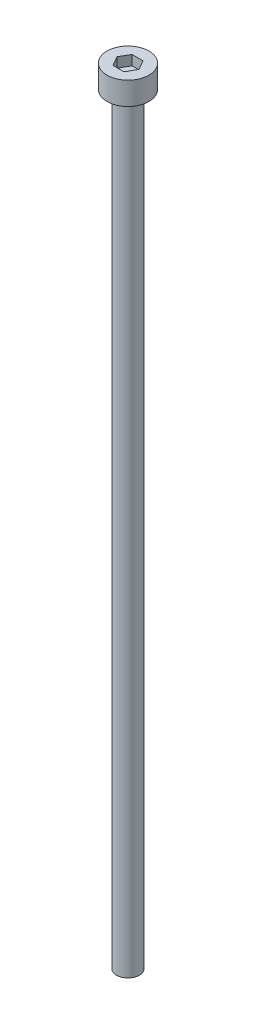
ISO-10303-21;
HEADER;
FILE_DESCRIPTION(('STEP AP214'),'2;1');
FILE_NAME('part.step','',(''),(''),'','','');
FILE_SCHEMA(('AUTOMOTIVE_DESIGN { 1 0 10303 214 1 1 1 1 }'));
ENDSEC;
DATA;
#1=APPLICATION_CONTEXT('core data for automotive mechanical design processes');
#2=APPLICATION_PROTOCOL_DEFINITION('international standard','automotive_design',2000,#1);
#3=PRODUCT_CONTEXT('',#1,'mechanical');
#4=PRODUCT('Part','Part','',(#3));
#5=PRODUCT_RELATED_PRODUCT_CATEGORY('part','',(#4));
#6=PRODUCT_DEFINITION_FORMATION('','',#4);
#7=PRODUCT_DEFINITION_CONTEXT('part definition',#1,'design');
#8=PRODUCT_DEFINITION('design','',#6,#7);
#9=PRODUCT_DEFINITION_SHAPE('','',#8);
#10=(LENGTH_UNIT() NAMED_UNIT(*) SI_UNIT(.MILLI.,.METRE.));
#11=(NAMED_UNIT(*) PLANE_ANGLE_UNIT() SI_UNIT($,.RADIAN.));
#12=(NAMED_UNIT(*) SI_UNIT($,.STERADIAN.) SOLID_ANGLE_UNIT());
#13=UNCERTAINTY_MEASURE_WITH_UNIT(LENGTH_MEASURE(1.E-05),#10,'distance_accuracy_value','');
#14=(GEOMETRIC_REPRESENTATION_CONTEXT(3) GLOBAL_UNCERTAINTY_ASSIGNED_CONTEXT((#13)) GLOBAL_UNIT_ASSIGNED_CONTEXT((#10,
#11,#12)) REPRESENTATION_CONTEXT('',''));
#15=CARTESIAN_POINT('',(0.,0.,0.));
#16=DIRECTION('',(0.,0.,1.));
#17=DIRECTION('',(1.,0.,0.));
#18=AXIS2_PLACEMENT_3D('',#15,#16,#17);
#19=CARTESIAN_POINT('',(0.,3.,0.));
#20=DIRECTION('',(0.,-1.,0.));
#21=DIRECTION('',(0.,0.,-1.));
#22=AXIS2_PLACEMENT_3D('',#19,#20,#21);
#23=CYLINDRICAL_SURFACE('',#22,2.75);
#24=CARTESIAN_POINT('',(0.,3.,0.));
#25=DIRECTION('',(0.,1.,0.));
#26=DIRECTION('',(0.,0.,1.));
#27=AXIS2_PLACEMENT_3D('',#24,#25,#26);
#28=CIRCLE('',#27,2.75);
#29=CARTESIAN_POINT('',(0.,3.,2.75));
#30=VERTEX_POINT('',#29);
#31=EDGE_CURVE('E45',#30,#30,#28,.T.);
#32=ORIENTED_EDGE('',*,*,#31,.F.);
#33=EDGE_LOOP('',(#32));
#34=FACE_BOUND('',#33,.T.);
#35=CARTESIAN_POINT('',(0.,0.,0.));
#36=DIRECTION('',(0.,1.,0.));
#37=DIRECTION('',(0.,0.,1.));
#38=AXIS2_PLACEMENT_3D('',#35,#36,#37);
#39=CIRCLE('',#38,2.75);
#40=CARTESIAN_POINT('',(0.,0.,2.75));
#41=VERTEX_POINT('',#40);
#42=EDGE_CURVE('E40',#41,#41,#39,.T.);
#43=ORIENTED_EDGE('',*,*,#42,.T.);
#44=EDGE_LOOP('',(#43));
#45=FACE_BOUND('',#44,.T.);
#46=ADVANCED_FACE('F37',(#34,#45),#23,.T.);
#47=CARTESIAN_POINT('',(0.,3.,0.));
#48=DIRECTION('',(0.,1.,0.));
#49=DIRECTION('',(0.,0.,1.));
#50=AXIS2_PLACEMENT_3D('',#47,#48,#49);
#51=PLANE('',#50);
#52=DIRECTION('',(0.5,0.,-0.866025403784439));
#53=VECTOR('',#52,1.);
#54=CARTESIAN_POINT('',(0.721687836487032,3.,1.25));
#55=LINE('',#54,#53);
#56=CARTESIAN_POINT('',(0.721687836487032,3.,1.25));
#57=VERTEX_POINT('',#56);
#58=CARTESIAN_POINT('',(1.44337567297406,3.,0.));
#59=VERTEX_POINT('',#58);
#60=EDGE_CURVE('E53',#57,#59,#55,.T.);
#61=ORIENTED_EDGE('',*,*,#60,.F.);
#62=DIRECTION('',(1.,0.,0.));
#63=VECTOR('',#62,1.);
#64=CARTESIAN_POINT('',(-0.721687836487033,3.,1.25));
#65=LINE('',#64,#63);
#66=CARTESIAN_POINT('',(-0.721687836487033,3.,1.25));
#67=VERTEX_POINT('',#66);
#68=EDGE_CURVE('E137',#67,#57,#65,.T.);
#69=ORIENTED_EDGE('',*,*,#68,.F.);
#70=DIRECTION('',(0.5,0.,0.866025403784439));
#71=VECTOR('',#70,1.);
#72=CARTESIAN_POINT('',(-1.44337567297407,3.,0.));
#73=LINE('',#72,#71);
#74=CARTESIAN_POINT('',(-1.44337567297407,3.,0.));
#75=VERTEX_POINT('',#74);
#76=EDGE_CURVE('E135',#75,#67,#73,.T.);
#77=ORIENTED_EDGE('',*,*,#76,.F.);
#78=DIRECTION('',(-0.5,0.,0.866025403784438));
#79=VECTOR('',#78,1.);
#80=CARTESIAN_POINT('',(-0.721687836487033,3.,-1.25));
#81=LINE('',#80,#79);
#82=CARTESIAN_POINT('',(-0.721687836487033,3.,-1.25));
#83=VERTEX_POINT('',#82);
#84=EDGE_CURVE('E101',#83,#75,#81,.T.);
#85=ORIENTED_EDGE('',*,*,#84,.F.);
#86=DIRECTION('',(-1.,0.,0.));
#87=VECTOR('',#86,1.);
#88=CARTESIAN_POINT('',(0.721687836487032,3.,-1.25));
#89=LINE('',#88,#87);
#90=CARTESIAN_POINT('',(0.721687836487032,3.,-1.25));
#91=VERTEX_POINT('',#90);
#92=EDGE_CURVE('E131',#91,#83,#89,.T.);
#93=ORIENTED_EDGE('',*,*,#92,.F.);
#94=DIRECTION('',(-0.5,0.,-0.866025403784439));
#95=VECTOR('',#94,1.);
#96=CARTESIAN_POINT('',(1.44337567297406,3.,0.));
#97=LINE('',#96,#95);
#98=EDGE_CURVE('E127',#59,#91,#97,.T.);
#99=ORIENTED_EDGE('',*,*,#98,.F.);
#100=EDGE_LOOP('',(#61,#69,#77,#85,#93,#99));
#101=FACE_BOUND('',#100,.T.);
#102=ORIENTED_EDGE('',*,*,#31,.T.);
#103=EDGE_LOOP('',(#102));
#104=FACE_BOUND('',#103,.T.);
#105=ADVANCED_FACE('F155',(#101,#104),#51,.T.);
#106=CARTESIAN_POINT('',(0.,0.,0.));
#107=DIRECTION('',(0.,1.,0.));
#108=DIRECTION('',(0.,0.,1.));
#109=AXIS2_PLACEMENT_3D('',#106,#107,#108);
#110=PLANE('',#109);
#111=CARTESIAN_POINT('',(0.,0.,0.));
#112=DIRECTION('',(0.,-1.,0.));
#113=DIRECTION('',(0.,0.,-1.));
#114=AXIS2_PLACEMENT_3D('',#111,#112,#113);
#115=CIRCLE('',#114,1.5);
#116=CARTESIAN_POINT('',(0.,0.,-1.5));
#117=VERTEX_POINT('',#116);
#118=EDGE_CURVE('E11',#117,#117,#115,.T.);
#119=ORIENTED_EDGE('',*,*,#118,.F.);
#120=EDGE_LOOP('',(#119));
#121=FACE_BOUND('',#120,.T.);
#122=ORIENTED_EDGE('',*,*,#42,.F.);
#123=EDGE_LOOP('',(#122));
#124=FACE_BOUND('',#123,.T.);
#125=ADVANCED_FACE('F152',(#121,#124),#110,.F.);
#126=CARTESIAN_POINT('',(0.721687836487032,1.7,1.25));
#127=DIRECTION('',(0.866025403784439,0.,0.5));
#128=DIRECTION('',(0.5,0.,-0.866025403784439));
#129=AXIS2_PLACEMENT_3D('',#126,#127,#128);
#130=PLANE('',#129);
#131=ORIENTED_EDGE('',*,*,#60,.T.);
#132=DIRECTION('',(0.,1.,0.));
#133=VECTOR('',#132,1.);
#134=CARTESIAN_POINT('',(1.44337567297406,1.7,0.));
#135=LINE('',#134,#133);
#136=CARTESIAN_POINT('',(1.44337567297406,1.7,0.));
#137=VERTEX_POINT('',#136);
#138=EDGE_CURVE('E83',#137,#59,#135,.T.);
#139=ORIENTED_EDGE('',*,*,#138,.F.);
#140=DIRECTION('',(0.5,0.,-0.866025403784439));
#141=VECTOR('',#140,1.);
#142=CARTESIAN_POINT('',(0.721687836487032,1.7,1.25));
#143=LINE('',#142,#141);
#144=CARTESIAN_POINT('',(0.721687836487032,1.7,1.25));
#145=VERTEX_POINT('',#144);
#146=EDGE_CURVE('E139',#145,#137,#143,.T.);
#147=ORIENTED_EDGE('',*,*,#146,.F.);
#148=DIRECTION('',(0.,1.,0.));
#149=VECTOR('',#148,1.);
#150=CARTESIAN_POINT('',(0.721687836487032,1.7,1.25));
#151=LINE('',#150,#149);
#152=EDGE_CURVE('E61',#145,#57,#151,.T.);
#153=ORIENTED_EDGE('',*,*,#152,.T.);
#154=EDGE_LOOP('',(#131,#139,#147,#153));
#155=FACE_BOUND('',#154,.T.);
#156=ADVANCED_FACE('F154',(#155),#130,.F.);
#157=CARTESIAN_POINT('',(-0.721687836487033,1.7,1.25));
#158=DIRECTION('',(0.,0.,1.));
#159=DIRECTION('',(1.,0.,0.));
#160=AXIS2_PLACEMENT_3D('',#157,#158,#159);
#161=PLANE('',#160);
#162=ORIENTED_EDGE('',*,*,#68,.T.);
#163=ORIENTED_EDGE('',*,*,#152,.F.);
#164=DIRECTION('',(1.,0.,0.));
#165=VECTOR('',#164,1.);
#166=CARTESIAN_POINT('',(-0.721687836487033,1.7,1.25));
#167=LINE('',#166,#165);
#168=CARTESIAN_POINT('',(-0.721687836487033,1.7,1.25));
#169=VERTEX_POINT('',#168);
#170=EDGE_CURVE('E113',#169,#145,#167,.T.);
#171=ORIENTED_EDGE('',*,*,#170,.F.);
#172=DIRECTION('',(0.,1.,0.));
#173=VECTOR('',#172,1.);
#174=CARTESIAN_POINT('',(-0.721687836487033,1.7,1.25));
#175=LINE('',#174,#173);
#176=EDGE_CURVE('E105',#169,#67,#175,.T.);
#177=ORIENTED_EDGE('',*,*,#176,.T.);
#178=EDGE_LOOP('',(#162,#163,#171,#177));
#179=FACE_BOUND('',#178,.T.);
#180=ADVANCED_FACE('F161',(#179),#161,.F.);
#181=CARTESIAN_POINT('',(-1.44337567297407,1.7,0.));
#182=DIRECTION('',(-0.866025403784439,0.,0.5));
#183=DIRECTION('',(0.5,0.,0.866025403784439));
#184=AXIS2_PLACEMENT_3D('',#181,#182,#183);
#185=PLANE('',#184);
#186=ORIENTED_EDGE('',*,*,#76,.T.);
#187=ORIENTED_EDGE('',*,*,#176,.F.);
#188=DIRECTION('',(0.5,0.,0.866025403784439));
#189=VECTOR('',#188,1.);
#190=CARTESIAN_POINT('',(-1.44337567297407,1.7,0.));
#191=LINE('',#190,#189);
#192=CARTESIAN_POINT('',(-1.44337567297407,1.7,0.));
#193=VERTEX_POINT('',#192);
#194=EDGE_CURVE('E109',#193,#169,#191,.T.);
#195=ORIENTED_EDGE('',*,*,#194,.F.);
#196=DIRECTION('',(0.,1.,0.));
#197=VECTOR('',#196,1.);
#198=CARTESIAN_POINT('',(-1.44337567297407,1.7,0.));
#199=LINE('',#198,#197);
#200=EDGE_CURVE('E94',#193,#75,#199,.T.);
#201=ORIENTED_EDGE('',*,*,#200,.T.);
#202=EDGE_LOOP('',(#186,#187,#195,#201));
#203=FACE_BOUND('',#202,.T.);
#204=ADVANCED_FACE('F110',(#203),#185,.F.);
#205=CARTESIAN_POINT('',(-0.721687836487033,1.7,-1.25));
#206=DIRECTION('',(-0.866025403784439,0.,-0.5));
#207=DIRECTION('',(-0.5,0.,0.866025403784439));
#208=AXIS2_PLACEMENT_3D('',#205,#206,#207);
#209=PLANE('',#208);
#210=ORIENTED_EDGE('',*,*,#84,.T.);
#211=ORIENTED_EDGE('',*,*,#200,.F.);
#212=DIRECTION('',(-0.5,0.,0.866025403784438));
#213=VECTOR('',#212,1.);
#214=CARTESIAN_POINT('',(-0.721687836487033,1.7,-1.25));
#215=LINE('',#214,#213);
#216=CARTESIAN_POINT('',(-0.721687836487033,1.7,-1.25));
#217=VERTEX_POINT('',#216);
#218=EDGE_CURVE('E98',#217,#193,#215,.T.);
#219=ORIENTED_EDGE('',*,*,#218,.F.);
#220=DIRECTION('',(0.,1.,0.));
#221=VECTOR('',#220,1.);
#222=CARTESIAN_POINT('',(-0.721687836487033,1.7,-1.25));
#223=LINE('',#222,#221);
#224=EDGE_CURVE('E106',#217,#83,#223,.T.);
#225=ORIENTED_EDGE('',*,*,#224,.T.);
#226=EDGE_LOOP('',(#210,#211,#219,#225));
#227=FACE_BOUND('',#226,.T.);
#228=ADVANCED_FACE('F96',(#227),#209,.F.);
#229=CARTESIAN_POINT('',(0.721687836487032,1.7,-1.25));
#230=DIRECTION('',(0.,0.,-1.));
#231=DIRECTION('',(-1.,0.,0.));
#232=AXIS2_PLACEMENT_3D('',#229,#230,#231);
#233=PLANE('',#232);
#234=ORIENTED_EDGE('',*,*,#92,.T.);
#235=ORIENTED_EDGE('',*,*,#224,.F.);
#236=DIRECTION('',(-1.,0.,0.));
#237=VECTOR('',#236,1.);
#238=CARTESIAN_POINT('',(0.721687836487032,1.7,-1.25));
#239=LINE('',#238,#237);
#240=CARTESIAN_POINT('',(0.721687836487032,1.7,-1.25));
#241=VERTEX_POINT('',#240);
#242=EDGE_CURVE('E119',#241,#217,#239,.T.);
#243=ORIENTED_EDGE('',*,*,#242,.F.);
#244=DIRECTION('',(0.,1.,0.));
#245=VECTOR('',#244,1.);
#246=CARTESIAN_POINT('',(0.721687836487032,1.7,-1.25));
#247=LINE('',#246,#245);
#248=EDGE_CURVE('E143',#241,#91,#247,.T.);
#249=ORIENTED_EDGE('',*,*,#248,.T.);
#250=EDGE_LOOP('',(#234,#235,#243,#249));
#251=FACE_BOUND('',#250,.T.);
#252=ADVANCED_FACE('F206',(#251),#233,.F.);
#253=CARTESIAN_POINT('',(1.44337567297406,1.7,0.));
#254=DIRECTION('',(0.866025403784439,0.,-0.5));
#255=DIRECTION('',(-0.5,0.,-0.866025403784439));
#256=AXIS2_PLACEMENT_3D('',#253,#254,#255);
#257=PLANE('',#256);
#258=ORIENTED_EDGE('',*,*,#98,.T.);
#259=ORIENTED_EDGE('',*,*,#248,.F.);
#260=DIRECTION('',(-0.5,0.,-0.866025403784439));
#261=VECTOR('',#260,1.);
#262=CARTESIAN_POINT('',(1.44337567297406,1.7,0.));
#263=LINE('',#262,#261);
#264=EDGE_CURVE('E121',#137,#241,#263,.T.);
#265=ORIENTED_EDGE('',*,*,#264,.F.);
#266=ORIENTED_EDGE('',*,*,#138,.T.);
#267=EDGE_LOOP('',(#258,#259,#265,#266));
#268=FACE_BOUND('',#267,.T.);
#269=ADVANCED_FACE('F215',(#268),#257,.F.);
#270=CARTESIAN_POINT('',(0.,1.7,0.));
#271=DIRECTION('',(0.,1.,0.));
#272=DIRECTION('',(0.,0.,1.));
#273=AXIS2_PLACEMENT_3D('',#270,#271,#272);
#274=PLANE('',#273);
#275=ORIENTED_EDGE('',*,*,#146,.T.);
#276=ORIENTED_EDGE('',*,*,#264,.T.);
#277=ORIENTED_EDGE('',*,*,#242,.T.);
#278=ORIENTED_EDGE('',*,*,#218,.T.);
#279=ORIENTED_EDGE('',*,*,#194,.T.);
#280=ORIENTED_EDGE('',*,*,#170,.T.);
#281=EDGE_LOOP('',(#275,#276,#277,#278,#279,#280));
#282=FACE_BOUND('',#281,.T.);
#283=ADVANCED_FACE('F116',(#282),#274,.T.);
#284=CARTESIAN_POINT('',(0.,-100.,0.));
#285=DIRECTION('',(0.,1.,0.));
#286=DIRECTION('',(0.,0.,1.));
#287=AXIS2_PLACEMENT_3D('',#284,#285,#286);
#288=CYLINDRICAL_SURFACE('',#287,1.5);
#289=CARTESIAN_POINT('',(0.,-100.,0.));
#290=DIRECTION('',(0.,-1.,0.));
#291=DIRECTION('',(0.,0.,-1.));
#292=AXIS2_PLACEMENT_3D('',#289,#290,#291);
#293=CIRCLE('',#292,1.5);
#294=CARTESIAN_POINT('',(0.,-100.,-1.5));
#295=VERTEX_POINT('',#294);
#296=EDGE_CURVE('E128',#295,#295,#293,.T.);
#297=ORIENTED_EDGE('',*,*,#296,.F.);
#298=EDGE_LOOP('',(#297));
#299=FACE_BOUND('',#298,.T.);
#300=ORIENTED_EDGE('',*,*,#118,.T.);
#301=EDGE_LOOP('',(#300));
#302=FACE_BOUND('',#301,.T.);
#303=ADVANCED_FACE('F233',(#299,#302),#288,.T.);
#304=CARTESIAN_POINT('',(0.,-100.,0.));
#305=DIRECTION('',(0.,-1.,0.));
#306=DIRECTION('',(0.,0.,-1.));
#307=AXIS2_PLACEMENT_3D('',#304,#305,#306);
#308=PLANE('',#307);
#309=ORIENTED_EDGE('',*,*,#296,.T.);
#310=EDGE_LOOP('',(#309));
#311=FACE_BOUND('',#310,.T.);
#312=ADVANCED_FACE('F247',(#311),#308,.T.);
#313=CLOSED_SHELL('',(#46,#105,#125,#156,#180,#204,#228,#252,#269,#283,#303,#312));
#314=MANIFOLD_SOLID_BREP('B2',#313);
#315=ADVANCED_BREP_SHAPE_REPRESENTATION('',(#18,#314),#14);
#316=SHAPE_DEFINITION_REPRESENTATION(#9,#315);
ENDSEC;
END-ISO-10303-21;
